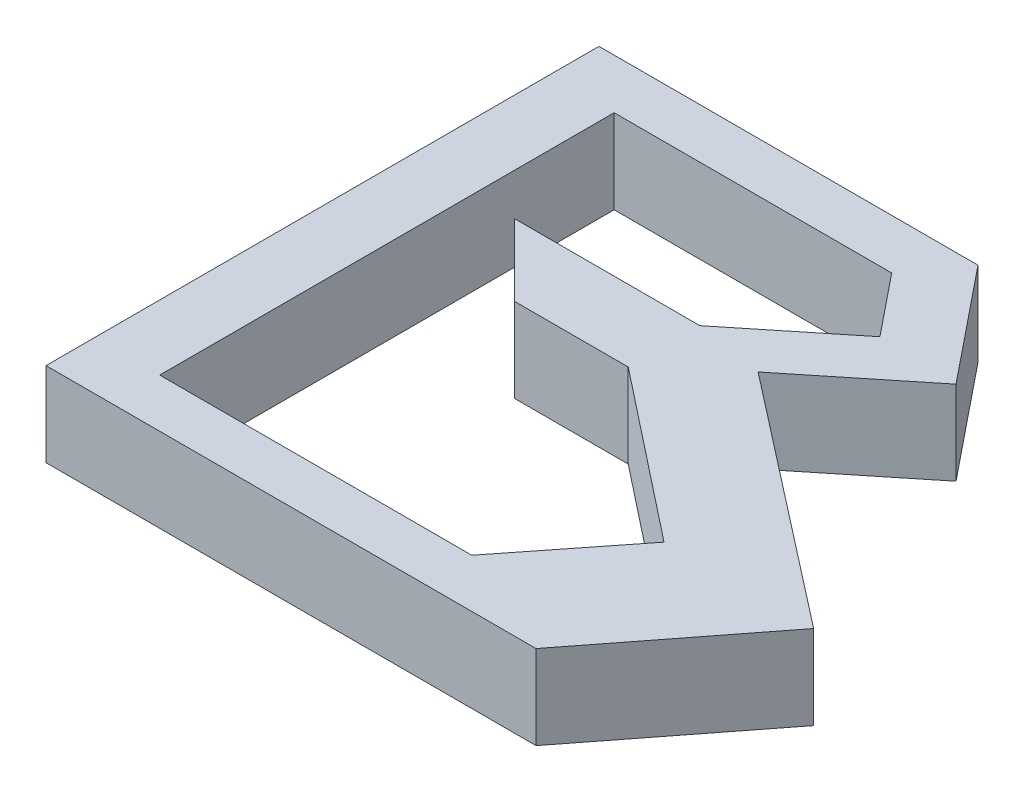
ISO-10303-21;
HEADER;
FILE_DESCRIPTION(('STEP AP214'),'2;1');
FILE_NAME('part.step','',(''),(''),'','','');
FILE_SCHEMA(('AUTOMOTIVE_DESIGN { 1 0 10303 214 1 1 1 1 }'));
ENDSEC;
DATA;
#1=APPLICATION_CONTEXT('core data for automotive mechanical design processes');
#2=APPLICATION_PROTOCOL_DEFINITION('international standard','automotive_design',2000,#1);
#3=PRODUCT_CONTEXT('',#1,'mechanical');
#4=PRODUCT('Part','Part','',(#3));
#5=PRODUCT_RELATED_PRODUCT_CATEGORY('part','',(#4));
#6=PRODUCT_DEFINITION_FORMATION('','',#4);
#7=PRODUCT_DEFINITION_CONTEXT('part definition',#1,'design');
#8=PRODUCT_DEFINITION('design','',#6,#7);
#9=PRODUCT_DEFINITION_SHAPE('','',#8);
#10=(LENGTH_UNIT() NAMED_UNIT(*) SI_UNIT(.MILLI.,.METRE.));
#11=(NAMED_UNIT(*) PLANE_ANGLE_UNIT() SI_UNIT($,.RADIAN.));
#12=(NAMED_UNIT(*) SI_UNIT($,.STERADIAN.) SOLID_ANGLE_UNIT());
#13=UNCERTAINTY_MEASURE_WITH_UNIT(LENGTH_MEASURE(1.E-05),#10,'distance_accuracy_value','');
#14=(GEOMETRIC_REPRESENTATION_CONTEXT(3) GLOBAL_UNCERTAINTY_ASSIGNED_CONTEXT((#13)) GLOBAL_UNIT_ASSIGNED_CONTEXT((#10,
#11,#12)) REPRESENTATION_CONTEXT('',''));
#15=CARTESIAN_POINT('',(0.,0.,0.));
#16=DIRECTION('',(0.,0.,1.));
#17=DIRECTION('',(1.,0.,0.));
#18=AXIS2_PLACEMENT_3D('',#15,#16,#17);
#19=CARTESIAN_POINT('',(0.,10.,0.));
#20=DIRECTION('',(0.,1.,0.));
#21=DIRECTION('',(0.,0.,1.));
#22=AXIS2_PLACEMENT_3D('',#19,#20,#21);
#23=PLANE('',#22);
#24=DIRECTION('',(-1.,0.,0.));
#25=VECTOR('',#24,1.);
#26=CARTESIAN_POINT('',(13.4858956140642,10.,-41.6490563580832));
#27=LINE('',#26,#25);
#28=CARTESIAN_POINT('',(13.4858956140642,10.,-41.6490563580832));
#29=VERTEX_POINT('',#28);
#30=CARTESIAN_POINT('',(-31.5913894976173,10.,-41.6490563580832));
#31=VERTEX_POINT('',#30);
#32=EDGE_CURVE('E230',#29,#31,#27,.T.);
#33=ORIENTED_EDGE('',*,*,#32,.T.);
#34=DIRECTION('',(0.,0.,1.));
#35=VECTOR('',#34,1.);
#36=CARTESIAN_POINT('',(-31.5913894976173,10.,-41.6490563580832));
#37=LINE('',#36,#35);
#38=CARTESIAN_POINT('',(-31.5913894976172,10.,24.1126115757324));
#39=VERTEX_POINT('',#38);
#40=EDGE_CURVE('E233',#31,#39,#37,.T.);
#41=ORIENTED_EDGE('',*,*,#40,.T.);
#42=DIRECTION('',(1.,0.,0.));
#43=VECTOR('',#42,1.);
#44=CARTESIAN_POINT('',(-31.5913894976172,10.,24.1126115757324));
#45=LINE('',#44,#43);
#46=CARTESIAN_POINT('',(26.6915005143134,10.,24.1126115757324));
#47=VERTEX_POINT('',#46);
#48=EDGE_CURVE('E236',#39,#47,#45,.T.);
#49=ORIENTED_EDGE('',*,*,#48,.T.);
#50=DIRECTION('',(0.61394061351492,0.,-0.789352217376326));
#51=VECTOR('',#50,1.);
#52=CARTESIAN_POINT('',(26.6915005143134,10.,24.1126115757324));
#53=LINE('',#52,#51);
#54=CARTESIAN_POINT('',(41.133278570367,10.,5.54461121794916));
#55=VERTEX_POINT('',#54);
#56=EDGE_CURVE('E238',#47,#55,#53,.T.);
#57=ORIENTED_EDGE('',*,*,#56,.T.);
#58=DIRECTION('',(-0.789352217376326,0.,-0.61394061351492));
#59=VECTOR('',#58,1.);
#60=CARTESIAN_POINT('',(41.133278570367,10.,5.54461121794916));
#61=LINE('',#60,#59);
#62=CARTESIAN_POINT('',(11.406624151416,10.,-17.5761199967905));
#63=VERTEX_POINT('',#62);
#64=EDGE_CURVE('E240',#55,#63,#61,.T.);
#65=ORIENTED_EDGE('',*,*,#64,.T.);
#66=DIRECTION('',(0.77814787192632,0.,-0.628081116908111));
#67=VECTOR('',#66,1.);
#68=CARTESIAN_POINT('',(11.406624151416,10.,-17.5761199967905));
#69=LINE('',#68,#67);
#70=CARTESIAN_POINT('',(24.4310589063317,10.,-28.0887768106086));
#71=VERTEX_POINT('',#70);
#72=EDGE_CURVE('E242',#63,#71,#69,.T.);
#73=ORIENTED_EDGE('',*,*,#72,.T.);
#74=DIRECTION('',(-0.628081116908111,0.,-0.77814787192632));
#75=VECTOR('',#74,1.);
#76=CARTESIAN_POINT('',(24.4310589063317,10.,-28.0887768106086));
#77=LINE('',#76,#75);
#78=EDGE_CURVE('E244',#71,#29,#77,.T.);
#79=ORIENTED_EDGE('',*,*,#78,.T.);
#80=EDGE_LOOP('',(#33,#41,#49,#57,#65,#73,#79));
#81=FACE_BOUND('',#80,.T.);
#82=DIRECTION('',(1.,0.,0.));
#83=VECTOR('',#82,1.);
#84=CARTESIAN_POINT('',(13.255885855573,10.,18.3251918790825));
#85=LINE('',#84,#83);
#86=CARTESIAN_POINT('',(-23.8547226818742,10.,18.3251918790825));
#87=VERTEX_POINT('',#86);
#88=CARTESIAN_POINT('',(13.255885855573,10.,18.3251918790825));
#89=VERTEX_POINT('',#88);
#90=EDGE_CURVE('E159',#87,#89,#85,.T.);
#91=ORIENTED_EDGE('',*,*,#90,.F.);
#92=DIRECTION('',(0.,0.,1.));
#93=VECTOR('',#92,1.);
#94=CARTESIAN_POINT('',(-23.8547226818742,10.,18.3251918790825));
#95=LINE('',#94,#93);
#96=CARTESIAN_POINT('',(-23.8547226818742,10.,-35.7176117993469));
#97=VERTEX_POINT('',#96);
#98=EDGE_CURVE('E151',#97,#87,#95,.T.);
#99=ORIENTED_EDGE('',*,*,#98,.F.);
#100=DIRECTION('',(-1.,0.,0.));
#101=VECTOR('',#100,1.);
#102=CARTESIAN_POINT('',(-23.8547226818742,10.,-35.7176117993469));
#103=LINE('',#102,#101);
#104=CARTESIAN_POINT('',(9.15505573196257,10.,-35.7176117993469));
#105=VERTEX_POINT('',#104);
#106=EDGE_CURVE('E188',#105,#97,#103,.T.);
#107=ORIENTED_EDGE('',*,*,#106,.F.);
#108=DIRECTION('',(-0.628081116908111,0.,-0.77814787192632));
#109=VECTOR('',#108,1.);
#110=CARTESIAN_POINT('',(9.15505573196257,10.,-35.7176117993469));
#111=LINE('',#110,#109);
#112=CARTESIAN_POINT('',(15.0228512165057,10.,-28.4478301640169));
#113=VERTEX_POINT('',#112);
#114=EDGE_CURVE('E186',#113,#105,#111,.T.);
#115=ORIENTED_EDGE('',*,*,#114,.F.);
#116=DIRECTION('',(0.77814787192632,0.,-0.628081116908111));
#117=VECTOR('',#116,1.);
#118=CARTESIAN_POINT('',(15.0228512165057,10.,-28.4478301640169));
#119=LINE('',#118,#117);
#120=CARTESIAN_POINT('',(3.172826816988,10.,-18.8830972530179));
#121=VERTEX_POINT('',#120);
#122=EDGE_CURVE('E184',#121,#113,#119,.T.);
#123=ORIENTED_EDGE('',*,*,#122,.F.);
#124=DIRECTION('',(1.,0.,0.));
#125=VECTOR('',#124,1.);
#126=CARTESIAN_POINT('',(3.172826816988,10.,-18.8830972530179));
#127=LINE('',#126,#125);
#128=CARTESIAN_POINT('',(-18.8830972530179,10.,-18.8830972530179));
#129=VERTEX_POINT('',#128);
#130=EDGE_CURVE('E182',#129,#121,#127,.T.);
#131=ORIENTED_EDGE('',*,*,#130,.F.);
#132=DIRECTION('',(-0.707106781186547,0.,-0.707106781186547));
#133=VECTOR('',#132,1.);
#134=CARTESIAN_POINT('',(-18.8830972530179,10.,-18.8830972530179));
#135=LINE('',#134,#133);
#136=CARTESIAN_POINT('',(-10.3651635053186,10.,-10.3651635053186));
#137=VERTEX_POINT('',#136);
#138=EDGE_CURVE('E180',#137,#129,#135,.T.);
#139=ORIENTED_EDGE('',*,*,#138,.F.);
#140=DIRECTION('',(-1.,0.,0.));
#141=VECTOR('',#140,1.);
#142=CARTESIAN_POINT('',(-10.3651635053186,10.,-10.3651635053186));
#143=LINE('',#142,#141);
#144=CARTESIAN_POINT('',(3.172826816988,10.,-10.3651635053186));
#145=VERTEX_POINT('',#144);
#146=EDGE_CURVE('E178',#145,#137,#143,.T.);
#147=ORIENTED_EDGE('',*,*,#146,.F.);
#148=DIRECTION('',(-0.785088058540035,0.,-0.619384162162577));
#149=VECTOR('',#148,1.);
#150=CARTESIAN_POINT('',(3.172826816988,10.,-10.3651635053186));
#151=LINE('',#150,#149);
#152=CARTESIAN_POINT('',(23.3389448941581,10.,5.54461121794916));
#153=VERTEX_POINT('',#152);
#154=EDGE_CURVE('E174',#153,#145,#151,.T.);
#155=ORIENTED_EDGE('',*,*,#154,.F.);
#156=DIRECTION('',(0.619384162162578,0.,-0.785088058540035));
#157=VECTOR('',#156,1.);
#158=CARTESIAN_POINT('',(23.3389448941581,10.,5.54461121794916));
#159=LINE('',#158,#157);
#160=EDGE_CURVE('E172',#89,#153,#159,.T.);
#161=ORIENTED_EDGE('',*,*,#160,.F.);
#162=EDGE_LOOP('',(#91,#99,#107,#115,#123,#131,#139,#147,#155,#161));
#163=FACE_BOUND('',#162,.T.);
#164=ADVANCED_FACE('F32',(#81,#163),#23,.T.);
#165=CARTESIAN_POINT('',(0.,0.,0.));
#166=DIRECTION('',(0.,1.,0.));
#167=DIRECTION('',(0.,0.,1.));
#168=AXIS2_PLACEMENT_3D('',#165,#166,#167);
#169=PLANE('',#168);
#170=DIRECTION('',(-1.,0.,0.));
#171=VECTOR('',#170,1.);
#172=CARTESIAN_POINT('',(13.4858956140642,0.,-41.6490563580832));
#173=LINE('',#172,#171);
#174=CARTESIAN_POINT('',(13.4858956140642,0.,-41.6490563580832));
#175=VERTEX_POINT('',#174);
#176=CARTESIAN_POINT('',(-31.5913894976173,0.,-41.6490563580832));
#177=VERTEX_POINT('',#176);
#178=EDGE_CURVE('E167',#175,#177,#173,.T.);
#179=ORIENTED_EDGE('',*,*,#178,.F.);
#180=DIRECTION('',(-0.628081116908111,0.,-0.77814787192632));
#181=VECTOR('',#180,1.);
#182=CARTESIAN_POINT('',(24.4310589063317,0.,-28.0887768106086));
#183=LINE('',#182,#181);
#184=CARTESIAN_POINT('',(24.4310589063317,0.,-28.0887768106086));
#185=VERTEX_POINT('',#184);
#186=EDGE_CURVE('E234',#185,#175,#183,.T.);
#187=ORIENTED_EDGE('',*,*,#186,.F.);
#188=DIRECTION('',(0.77814787192632,0.,-0.628081116908111));
#189=VECTOR('',#188,1.);
#190=CARTESIAN_POINT('',(11.406624151416,0.,-17.5761199967905));
#191=LINE('',#190,#189);
#192=CARTESIAN_POINT('',(11.406624151416,0.,-17.5761199967905));
#193=VERTEX_POINT('',#192);
#194=EDGE_CURVE('E257',#193,#185,#191,.T.);
#195=ORIENTED_EDGE('',*,*,#194,.F.);
#196=DIRECTION('',(-0.789352217376326,0.,-0.61394061351492));
#197=VECTOR('',#196,1.);
#198=CARTESIAN_POINT('',(41.133278570367,0.,5.54461121794916));
#199=LINE('',#198,#197);
#200=CARTESIAN_POINT('',(41.133278570367,0.,5.54461121794916));
#201=VERTEX_POINT('',#200);
#202=EDGE_CURVE('E255',#201,#193,#199,.T.);
#203=ORIENTED_EDGE('',*,*,#202,.F.);
#204=DIRECTION('',(0.61394061351492,0.,-0.789352217376326));
#205=VECTOR('',#204,1.);
#206=CARTESIAN_POINT('',(26.6915005143134,0.,24.1126115757324));
#207=LINE('',#206,#205);
#208=CARTESIAN_POINT('',(26.6915005143134,0.,24.1126115757324));
#209=VERTEX_POINT('',#208);
#210=EDGE_CURVE('E253',#209,#201,#207,.T.);
#211=ORIENTED_EDGE('',*,*,#210,.F.);
#212=DIRECTION('',(1.,0.,0.));
#213=VECTOR('',#212,1.);
#214=CARTESIAN_POINT('',(-31.5913894976172,0.,24.1126115757324));
#215=LINE('',#214,#213);
#216=CARTESIAN_POINT('',(-31.5913894976172,0.,24.1126115757324));
#217=VERTEX_POINT('',#216);
#218=EDGE_CURVE('E251',#217,#209,#215,.T.);
#219=ORIENTED_EDGE('',*,*,#218,.F.);
#220=DIRECTION('',(0.,0.,1.));
#221=VECTOR('',#220,1.);
#222=CARTESIAN_POINT('',(-31.5913894976173,0.,-41.6490563580832));
#223=LINE('',#222,#221);
#224=EDGE_CURVE('E249',#177,#217,#223,.T.);
#225=ORIENTED_EDGE('',*,*,#224,.F.);
#226=EDGE_LOOP('',(#179,#187,#195,#203,#211,#219,#225));
#227=FACE_BOUND('',#226,.T.);
#228=DIRECTION('',(0.,0.,1.));
#229=VECTOR('',#228,1.);
#230=CARTESIAN_POINT('',(-23.8547226818742,0.,18.3251918790825));
#231=LINE('',#230,#229);
#232=CARTESIAN_POINT('',(-23.8547226818742,0.,-35.7176117993469));
#233=VERTEX_POINT('',#232);
#234=CARTESIAN_POINT('',(-23.8547226818742,0.,18.3251918790825));
#235=VERTEX_POINT('',#234);
#236=EDGE_CURVE('E55',#233,#235,#231,.T.);
#237=ORIENTED_EDGE('',*,*,#236,.T.);
#238=DIRECTION('',(1.,0.,0.));
#239=VECTOR('',#238,1.);
#240=CARTESIAN_POINT('',(13.255885855573,0.,18.3251918790825));
#241=LINE('',#240,#239);
#242=CARTESIAN_POINT('',(13.255885855573,0.,18.3251918790825));
#243=VERTEX_POINT('',#242);
#244=EDGE_CURVE('E166',#235,#243,#241,.T.);
#245=ORIENTED_EDGE('',*,*,#244,.T.);
#246=DIRECTION('',(0.619384162162578,0.,-0.785088058540035));
#247=VECTOR('',#246,1.);
#248=CARTESIAN_POINT('',(23.3389448941581,0.,5.54461121794916));
#249=LINE('',#248,#247);
#250=CARTESIAN_POINT('',(23.3389448941581,0.,5.54461121794916));
#251=VERTEX_POINT('',#250);
#252=EDGE_CURVE('E192',#243,#251,#249,.T.);
#253=ORIENTED_EDGE('',*,*,#252,.T.);
#254=DIRECTION('',(-0.785088058540035,0.,-0.619384162162577));
#255=VECTOR('',#254,1.);
#256=CARTESIAN_POINT('',(3.172826816988,0.,-10.3651635053186));
#257=LINE('',#256,#255);
#258=CARTESIAN_POINT('',(3.172826816988,0.,-10.3651635053186));
#259=VERTEX_POINT('',#258);
#260=EDGE_CURVE('E195',#251,#259,#257,.T.);
#261=ORIENTED_EDGE('',*,*,#260,.T.);
#262=DIRECTION('',(-1.,0.,0.));
#263=VECTOR('',#262,1.);
#264=CARTESIAN_POINT('',(-10.3651635053186,0.,-10.3651635053186));
#265=LINE('',#264,#263);
#266=CARTESIAN_POINT('',(-10.3651635053186,0.,-10.3651635053186));
#267=VERTEX_POINT('',#266);
#268=EDGE_CURVE('E198',#259,#267,#265,.T.);
#269=ORIENTED_EDGE('',*,*,#268,.T.);
#270=DIRECTION('',(-0.707106781186547,0.,-0.707106781186547));
#271=VECTOR('',#270,1.);
#272=CARTESIAN_POINT('',(-18.8830972530179,0.,-18.8830972530179));
#273=LINE('',#272,#271);
#274=CARTESIAN_POINT('',(-18.8830972530179,0.,-18.8830972530179));
#275=VERTEX_POINT('',#274);
#276=EDGE_CURVE('E201',#267,#275,#273,.T.);
#277=ORIENTED_EDGE('',*,*,#276,.T.);
#278=DIRECTION('',(1.,0.,0.));
#279=VECTOR('',#278,1.);
#280=CARTESIAN_POINT('',(3.172826816988,0.,-18.8830972530179));
#281=LINE('',#280,#279);
#282=CARTESIAN_POINT('',(3.172826816988,0.,-18.8830972530179));
#283=VERTEX_POINT('',#282);
#284=EDGE_CURVE('E204',#275,#283,#281,.T.);
#285=ORIENTED_EDGE('',*,*,#284,.T.);
#286=DIRECTION('',(0.77814787192632,0.,-0.628081116908111));
#287=VECTOR('',#286,1.);
#288=CARTESIAN_POINT('',(15.0228512165057,0.,-28.4478301640169));
#289=LINE('',#288,#287);
#290=CARTESIAN_POINT('',(15.0228512165057,0.,-28.4478301640169));
#291=VERTEX_POINT('',#290);
#292=EDGE_CURVE('E207',#283,#291,#289,.T.);
#293=ORIENTED_EDGE('',*,*,#292,.T.);
#294=DIRECTION('',(-0.628081116908111,0.,-0.77814787192632));
#295=VECTOR('',#294,1.);
#296=CARTESIAN_POINT('',(9.15505573196257,0.,-35.7176117993469));
#297=LINE('',#296,#295);
#298=CARTESIAN_POINT('',(9.15505573196257,0.,-35.7176117993469));
#299=VERTEX_POINT('',#298);
#300=EDGE_CURVE('E210',#291,#299,#297,.T.);
#301=ORIENTED_EDGE('',*,*,#300,.T.);
#302=DIRECTION('',(-1.,0.,0.));
#303=VECTOR('',#302,1.);
#304=CARTESIAN_POINT('',(-23.8547226818742,0.,-35.7176117993469));
#305=LINE('',#304,#303);
#306=EDGE_CURVE('E160',#299,#233,#305,.T.);
#307=ORIENTED_EDGE('',*,*,#306,.T.);
#308=EDGE_LOOP('',(#237,#245,#253,#261,#269,#277,#285,#293,#301,#307));
#309=FACE_BOUND('',#308,.T.);
#310=ADVANCED_FACE('F284',(#227,#309),#169,.F.);
#311=CARTESIAN_POINT('',(13.4858956140642,10.,-41.6490563580832));
#312=DIRECTION('',(0.,0.,1.));
#313=DIRECTION('',(1.,0.,0.));
#314=AXIS2_PLACEMENT_3D('',#311,#312,#313);
#315=PLANE('',#314);
#316=ORIENTED_EDGE('',*,*,#178,.T.);
#317=DIRECTION('',(0.,-1.,0.));
#318=VECTOR('',#317,1.);
#319=CARTESIAN_POINT('',(-31.5913894976173,10.,-41.6490563580832));
#320=LINE('',#319,#318);
#321=EDGE_CURVE('E11',#31,#177,#320,.T.);
#322=ORIENTED_EDGE('',*,*,#321,.F.);
#323=ORIENTED_EDGE('',*,*,#32,.F.);
#324=DIRECTION('',(0.,-1.,0.));
#325=VECTOR('',#324,1.);
#326=CARTESIAN_POINT('',(13.4858956140642,10.,-41.6490563580832));
#327=LINE('',#326,#325);
#328=EDGE_CURVE('E246',#29,#175,#327,.T.);
#329=ORIENTED_EDGE('',*,*,#328,.T.);
#330=EDGE_LOOP('',(#316,#322,#323,#329));
#331=FACE_BOUND('',#330,.T.);
#332=ADVANCED_FACE('F34',(#331),#315,.F.);
#333=CARTESIAN_POINT('',(-31.5913894976173,10.,-41.6490563580832));
#334=DIRECTION('',(1.,0.,0.));
#335=DIRECTION('',(0.,0.,-1.));
#336=AXIS2_PLACEMENT_3D('',#333,#334,#335);
#337=PLANE('',#336);
#338=ORIENTED_EDGE('',*,*,#224,.T.);
#339=DIRECTION('',(0.,-1.,0.));
#340=VECTOR('',#339,1.);
#341=CARTESIAN_POINT('',(-31.5913894976172,10.,24.1126115757324));
#342=LINE('',#341,#340);
#343=EDGE_CURVE('E40',#39,#217,#342,.T.);
#344=ORIENTED_EDGE('',*,*,#343,.F.);
#345=ORIENTED_EDGE('',*,*,#40,.F.);
#346=ORIENTED_EDGE('',*,*,#321,.T.);
#347=EDGE_LOOP('',(#338,#344,#345,#346));
#348=FACE_BOUND('',#347,.T.);
#349=ADVANCED_FACE('F301',(#348),#337,.F.);
#350=CARTESIAN_POINT('',(-31.5913894976172,10.,24.1126115757324));
#351=DIRECTION('',(0.,0.,-1.));
#352=DIRECTION('',(-1.,0.,0.));
#353=AXIS2_PLACEMENT_3D('',#350,#351,#352);
#354=PLANE('',#353);
#355=ORIENTED_EDGE('',*,*,#218,.T.);
#356=DIRECTION('',(0.,-1.,0.));
#357=VECTOR('',#356,1.);
#358=CARTESIAN_POINT('',(26.6915005143134,10.,24.1126115757324));
#359=LINE('',#358,#357);
#360=EDGE_CURVE('E271',#47,#209,#359,.T.);
#361=ORIENTED_EDGE('',*,*,#360,.F.);
#362=ORIENTED_EDGE('',*,*,#48,.F.);
#363=ORIENTED_EDGE('',*,*,#343,.T.);
#364=EDGE_LOOP('',(#355,#361,#362,#363));
#365=FACE_BOUND('',#364,.T.);
#366=ADVANCED_FACE('F278',(#365),#354,.F.);
#367=CARTESIAN_POINT('',(26.6915005143134,10.,24.1126115757324));
#368=DIRECTION('',(-0.789352217376326,0.,-0.61394061351492));
#369=DIRECTION('',(-0.61394061351492,0.,0.789352217376326));
#370=AXIS2_PLACEMENT_3D('',#367,#368,#369);
#371=PLANE('',#370);
#372=ORIENTED_EDGE('',*,*,#210,.T.);
#373=DIRECTION('',(0.,-1.,0.));
#374=VECTOR('',#373,1.);
#375=CARTESIAN_POINT('',(41.133278570367,10.,5.54461121794916));
#376=LINE('',#375,#374);
#377=EDGE_CURVE('E268',#55,#201,#376,.T.);
#378=ORIENTED_EDGE('',*,*,#377,.F.);
#379=ORIENTED_EDGE('',*,*,#56,.F.);
#380=ORIENTED_EDGE('',*,*,#360,.T.);
#381=EDGE_LOOP('',(#372,#378,#379,#380));
#382=FACE_BOUND('',#381,.T.);
#383=ADVANCED_FACE('F290',(#382),#371,.F.);
#384=CARTESIAN_POINT('',(41.133278570367,10.,5.54461121794916));
#385=DIRECTION('',(-0.61394061351492,0.,0.789352217376326));
#386=DIRECTION('',(0.789352217376326,0.,0.61394061351492));
#387=AXIS2_PLACEMENT_3D('',#384,#385,#386);
#388=PLANE('',#387);
#389=ORIENTED_EDGE('',*,*,#202,.T.);
#390=DIRECTION('',(0.,-1.,0.));
#391=VECTOR('',#390,1.);
#392=CARTESIAN_POINT('',(11.406624151416,10.,-17.5761199967905));
#393=LINE('',#392,#391);
#394=EDGE_CURVE('E265',#63,#193,#393,.T.);
#395=ORIENTED_EDGE('',*,*,#394,.F.);
#396=ORIENTED_EDGE('',*,*,#64,.F.);
#397=ORIENTED_EDGE('',*,*,#377,.T.);
#398=EDGE_LOOP('',(#389,#395,#396,#397));
#399=FACE_BOUND('',#398,.T.);
#400=ADVANCED_FACE('F294',(#399),#388,.F.);
#401=CARTESIAN_POINT('',(11.406624151416,10.,-17.5761199967905));
#402=DIRECTION('',(-0.628081116908111,0.,-0.77814787192632));
#403=DIRECTION('',(-0.77814787192632,0.,0.628081116908111));
#404=AXIS2_PLACEMENT_3D('',#401,#402,#403);
#405=PLANE('',#404);
#406=ORIENTED_EDGE('',*,*,#194,.T.);
#407=DIRECTION('',(0.,-1.,0.));
#408=VECTOR('',#407,1.);
#409=CARTESIAN_POINT('',(24.4310589063317,10.,-28.0887768106086));
#410=LINE('',#409,#408);
#411=EDGE_CURVE('E262',#71,#185,#410,.T.);
#412=ORIENTED_EDGE('',*,*,#411,.F.);
#413=ORIENTED_EDGE('',*,*,#72,.F.);
#414=ORIENTED_EDGE('',*,*,#394,.T.);
#415=EDGE_LOOP('',(#406,#412,#413,#414));
#416=FACE_BOUND('',#415,.T.);
#417=ADVANCED_FACE('F309',(#416),#405,.F.);
#418=CARTESIAN_POINT('',(24.4310589063317,10.,-28.0887768106086));
#419=DIRECTION('',(-0.77814787192632,0.,0.628081116908111));
#420=DIRECTION('',(0.628081116908111,0.,0.77814787192632));
#421=AXIS2_PLACEMENT_3D('',#418,#419,#420);
#422=PLANE('',#421);
#423=ORIENTED_EDGE('',*,*,#186,.T.);
#424=ORIENTED_EDGE('',*,*,#328,.F.);
#425=ORIENTED_EDGE('',*,*,#78,.F.);
#426=ORIENTED_EDGE('',*,*,#411,.T.);
#427=EDGE_LOOP('',(#423,#424,#425,#426));
#428=FACE_BOUND('',#427,.T.);
#429=ADVANCED_FACE('F306',(#428),#422,.F.);
#430=CARTESIAN_POINT('',(-23.8547226818742,10.,18.3251918790825));
#431=DIRECTION('',(1.,0.,0.));
#432=DIRECTION('',(0.,0.,-1.));
#433=AXIS2_PLACEMENT_3D('',#430,#431,#432);
#434=PLANE('',#433);
#435=ORIENTED_EDGE('',*,*,#236,.F.);
#436=DIRECTION('',(0.,-1.,0.));
#437=VECTOR('',#436,1.);
#438=CARTESIAN_POINT('',(-23.8547226818742,10.,-35.7176117993469));
#439=LINE('',#438,#437);
#440=EDGE_CURVE('E155',#97,#233,#439,.T.);
#441=ORIENTED_EDGE('',*,*,#440,.F.);
#442=ORIENTED_EDGE('',*,*,#98,.T.);
#443=DIRECTION('',(0.,-1.,0.));
#444=VECTOR('',#443,1.);
#445=CARTESIAN_POINT('',(-23.8547226818742,10.,18.3251918790825));
#446=LINE('',#445,#444);
#447=EDGE_CURVE('E154',#87,#235,#446,.T.);
#448=ORIENTED_EDGE('',*,*,#447,.T.);
#449=EDGE_LOOP('',(#435,#441,#442,#448));
#450=FACE_BOUND('',#449,.T.);
#451=ADVANCED_FACE('F153',(#450),#434,.T.);
#452=CARTESIAN_POINT('',(13.255885855573,10.,18.3251918790825));
#453=DIRECTION('',(0.,0.,-1.));
#454=DIRECTION('',(-1.,0.,0.));
#455=AXIS2_PLACEMENT_3D('',#452,#453,#454);
#456=PLANE('',#455);
#457=ORIENTED_EDGE('',*,*,#244,.F.);
#458=ORIENTED_EDGE('',*,*,#447,.F.);
#459=ORIENTED_EDGE('',*,*,#90,.T.);
#460=DIRECTION('',(0.,-1.,0.));
#461=VECTOR('',#460,1.);
#462=CARTESIAN_POINT('',(13.255885855573,10.,18.3251918790825));
#463=LINE('',#462,#461);
#464=EDGE_CURVE('E168',#89,#243,#463,.T.);
#465=ORIENTED_EDGE('',*,*,#464,.T.);
#466=EDGE_LOOP('',(#457,#458,#459,#465));
#467=FACE_BOUND('',#466,.T.);
#468=ADVANCED_FACE('F163',(#467),#456,.T.);
#469=CARTESIAN_POINT('',(23.3389448941581,10.,5.54461121794916));
#470=DIRECTION('',(-0.785088058540035,0.,-0.619384162162578));
#471=DIRECTION('',(-0.619384162162578,0.,0.785088058540035));
#472=AXIS2_PLACEMENT_3D('',#469,#470,#471);
#473=PLANE('',#472);
#474=ORIENTED_EDGE('',*,*,#252,.F.);
#475=ORIENTED_EDGE('',*,*,#464,.F.);
#476=ORIENTED_EDGE('',*,*,#160,.T.);
#477=DIRECTION('',(0.,-1.,0.));
#478=VECTOR('',#477,1.);
#479=CARTESIAN_POINT('',(23.3389448941581,10.,5.54461121794916));
#480=LINE('',#479,#478);
#481=EDGE_CURVE('E227',#153,#251,#480,.T.);
#482=ORIENTED_EDGE('',*,*,#481,.T.);
#483=EDGE_LOOP('',(#474,#475,#476,#482));
#484=FACE_BOUND('',#483,.T.);
#485=ADVANCED_FACE('F329',(#484),#473,.T.);
#486=CARTESIAN_POINT('',(3.172826816988,10.,-10.3651635053186));
#487=DIRECTION('',(-0.619384162162577,0.,0.785088058540035));
#488=DIRECTION('',(0.785088058540035,0.,0.619384162162578));
#489=AXIS2_PLACEMENT_3D('',#486,#487,#488);
#490=PLANE('',#489);
#491=ORIENTED_EDGE('',*,*,#260,.F.);
#492=ORIENTED_EDGE('',*,*,#481,.F.);
#493=ORIENTED_EDGE('',*,*,#154,.T.);
#494=DIRECTION('',(0.,-1.,0.));
#495=VECTOR('',#494,1.);
#496=CARTESIAN_POINT('',(3.172826816988,10.,-10.3651635053186));
#497=LINE('',#496,#495);
#498=EDGE_CURVE('E225',#145,#259,#497,.T.);
#499=ORIENTED_EDGE('',*,*,#498,.T.);
#500=EDGE_LOOP('',(#491,#492,#493,#499));
#501=FACE_BOUND('',#500,.T.);
#502=ADVANCED_FACE('F332',(#501),#490,.T.);
#503=CARTESIAN_POINT('',(-10.3651635053186,10.,-10.3651635053186));
#504=DIRECTION('',(0.,0.,1.));
#505=DIRECTION('',(1.,0.,0.));
#506=AXIS2_PLACEMENT_3D('',#503,#504,#505);
#507=PLANE('',#506);
#508=ORIENTED_EDGE('',*,*,#268,.F.);
#509=ORIENTED_EDGE('',*,*,#498,.F.);
#510=ORIENTED_EDGE('',*,*,#146,.T.);
#511=DIRECTION('',(0.,-1.,0.));
#512=VECTOR('',#511,1.);
#513=CARTESIAN_POINT('',(-10.3651635053186,10.,-10.3651635053186));
#514=LINE('',#513,#512);
#515=EDGE_CURVE('E223',#137,#267,#514,.T.);
#516=ORIENTED_EDGE('',*,*,#515,.T.);
#517=EDGE_LOOP('',(#508,#509,#510,#516));
#518=FACE_BOUND('',#517,.T.);
#519=ADVANCED_FACE('F336',(#518),#507,.T.);
#520=CARTESIAN_POINT('',(-18.8830972530179,10.,-18.8830972530179));
#521=DIRECTION('',(-0.707106781186548,0.,0.707106781186548));
#522=DIRECTION('',(0.707106781186548,0.,0.707106781186548));
#523=AXIS2_PLACEMENT_3D('',#520,#521,#522);
#524=PLANE('',#523);
#525=ORIENTED_EDGE('',*,*,#276,.F.);
#526=ORIENTED_EDGE('',*,*,#515,.F.);
#527=ORIENTED_EDGE('',*,*,#138,.T.);
#528=DIRECTION('',(0.,-1.,0.));
#529=VECTOR('',#528,1.);
#530=CARTESIAN_POINT('',(-18.8830972530179,10.,-18.8830972530179));
#531=LINE('',#530,#529);
#532=EDGE_CURVE('E221',#129,#275,#531,.T.);
#533=ORIENTED_EDGE('',*,*,#532,.T.);
#534=EDGE_LOOP('',(#525,#526,#527,#533));
#535=FACE_BOUND('',#534,.T.);
#536=ADVANCED_FACE('F340',(#535),#524,.T.);
#537=CARTESIAN_POINT('',(3.172826816988,10.,-18.8830972530179));
#538=DIRECTION('',(0.,0.,-1.));
#539=DIRECTION('',(-1.,0.,0.));
#540=AXIS2_PLACEMENT_3D('',#537,#538,#539);
#541=PLANE('',#540);
#542=ORIENTED_EDGE('',*,*,#284,.F.);
#543=ORIENTED_EDGE('',*,*,#532,.F.);
#544=ORIENTED_EDGE('',*,*,#130,.T.);
#545=DIRECTION('',(0.,-1.,0.));
#546=VECTOR('',#545,1.);
#547=CARTESIAN_POINT('',(3.172826816988,10.,-18.8830972530179));
#548=LINE('',#547,#546);
#549=EDGE_CURVE('E219',#121,#283,#548,.T.);
#550=ORIENTED_EDGE('',*,*,#549,.T.);
#551=EDGE_LOOP('',(#542,#543,#544,#550));
#552=FACE_BOUND('',#551,.T.);
#553=ADVANCED_FACE('F344',(#552),#541,.T.);
#554=CARTESIAN_POINT('',(15.0228512165057,10.,-28.4478301640169));
#555=DIRECTION('',(-0.628081116908111,0.,-0.77814787192632));
#556=DIRECTION('',(-0.77814787192632,0.,0.628081116908111));
#557=AXIS2_PLACEMENT_3D('',#554,#555,#556);
#558=PLANE('',#557);
#559=ORIENTED_EDGE('',*,*,#292,.F.);
#560=ORIENTED_EDGE('',*,*,#549,.F.);
#561=ORIENTED_EDGE('',*,*,#122,.T.);
#562=DIRECTION('',(0.,-1.,0.));
#563=VECTOR('',#562,1.);
#564=CARTESIAN_POINT('',(15.0228512165057,10.,-28.4478301640169));
#565=LINE('',#564,#563);
#566=EDGE_CURVE('E217',#113,#291,#565,.T.);
#567=ORIENTED_EDGE('',*,*,#566,.T.);
#568=EDGE_LOOP('',(#559,#560,#561,#567));
#569=FACE_BOUND('',#568,.T.);
#570=ADVANCED_FACE('F348',(#569),#558,.T.);
#571=CARTESIAN_POINT('',(9.15505573196257,10.,-35.7176117993469));
#572=DIRECTION('',(-0.77814787192632,0.,0.628081116908111));
#573=DIRECTION('',(0.628081116908111,0.,0.77814787192632));
#574=AXIS2_PLACEMENT_3D('',#571,#572,#573);
#575=PLANE('',#574);
#576=ORIENTED_EDGE('',*,*,#300,.F.);
#577=ORIENTED_EDGE('',*,*,#566,.F.);
#578=ORIENTED_EDGE('',*,*,#114,.T.);
#579=DIRECTION('',(0.,-1.,0.));
#580=VECTOR('',#579,1.);
#581=CARTESIAN_POINT('',(9.15505573196257,10.,-35.7176117993469));
#582=LINE('',#581,#580);
#583=EDGE_CURVE('E47',#105,#299,#582,.T.);
#584=ORIENTED_EDGE('',*,*,#583,.T.);
#585=EDGE_LOOP('',(#576,#577,#578,#584));
#586=FACE_BOUND('',#585,.T.);
#587=ADVANCED_FACE('F352',(#586),#575,.T.);
#588=CARTESIAN_POINT('',(-23.8547226818742,10.,-35.7176117993469));
#589=DIRECTION('',(0.,0.,1.));
#590=DIRECTION('',(1.,0.,0.));
#591=AXIS2_PLACEMENT_3D('',#588,#589,#590);
#592=PLANE('',#591);
#593=ORIENTED_EDGE('',*,*,#306,.F.);
#594=ORIENTED_EDGE('',*,*,#583,.F.);
#595=ORIENTED_EDGE('',*,*,#106,.T.);
#596=ORIENTED_EDGE('',*,*,#440,.T.);
#597=EDGE_LOOP('',(#593,#594,#595,#596));
#598=FACE_BOUND('',#597,.T.);
#599=ADVANCED_FACE('F356',(#598),#592,.T.);
#600=CLOSED_SHELL('',(#164,#310,#332,#349,#366,#383,#400,#417,#429,#451,#468,#485,#502,#519,
#536,#553,#570,#587,#599));
#601=MANIFOLD_SOLID_BREP('B2',#600);
#602=ADVANCED_BREP_SHAPE_REPRESENTATION('',(#18,#601),#14);
#603=SHAPE_DEFINITION_REPRESENTATION(#9,#602);
ENDSEC;
END-ISO-10303-21;
